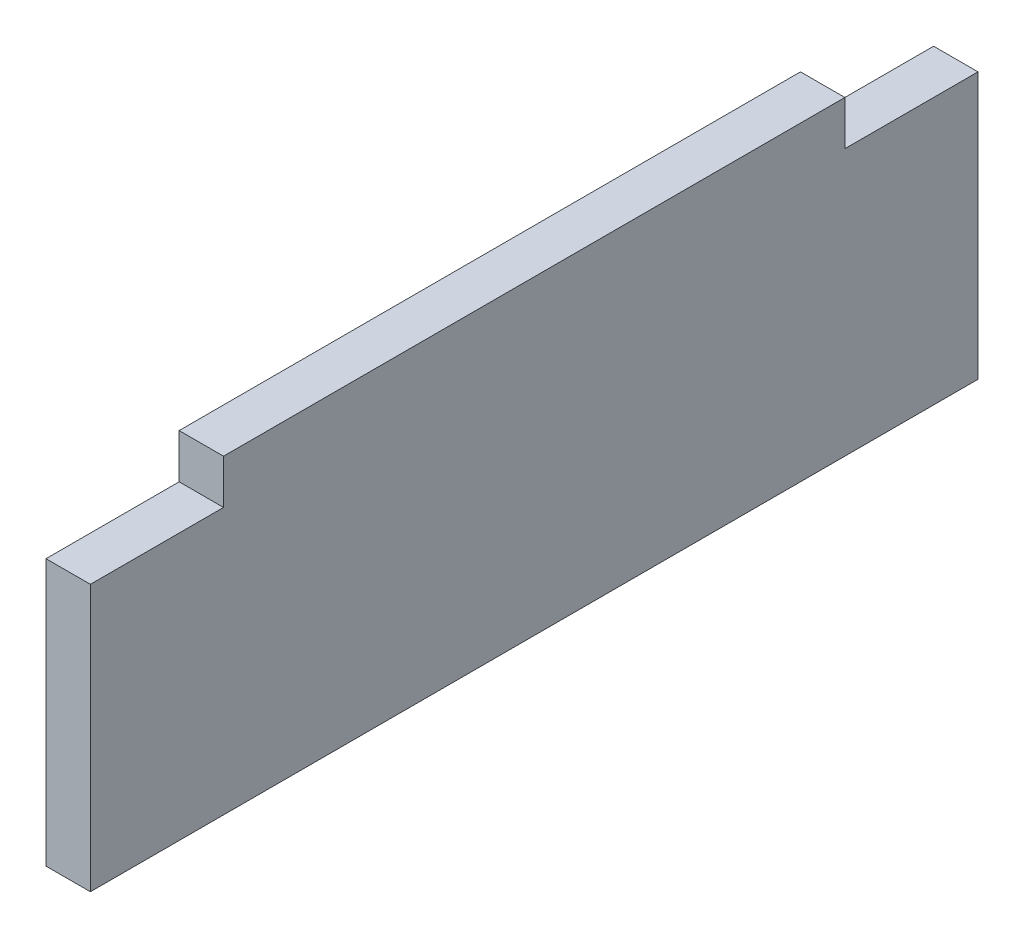
ISO-10303-21;
HEADER;
FILE_DESCRIPTION(('STEP AP214'),'2;1');
FILE_NAME('part.step','',(''),(''),'','','');
FILE_SCHEMA(('AUTOMOTIVE_DESIGN { 1 0 10303 214 1 1 1 1 }'));
ENDSEC;
DATA;
#1=APPLICATION_CONTEXT('core data for automotive mechanical design processes');
#2=APPLICATION_PROTOCOL_DEFINITION('international standard','automotive_design',2000,#1);
#3=PRODUCT_CONTEXT('',#1,'mechanical');
#4=PRODUCT('Part','Part','',(#3));
#5=PRODUCT_RELATED_PRODUCT_CATEGORY('part','',(#4));
#6=PRODUCT_DEFINITION_FORMATION('','',#4);
#7=PRODUCT_DEFINITION_CONTEXT('part definition',#1,'design');
#8=PRODUCT_DEFINITION('design','',#6,#7);
#9=PRODUCT_DEFINITION_SHAPE('','',#8);
#10=(LENGTH_UNIT() NAMED_UNIT(*) SI_UNIT(.MILLI.,.METRE.));
#11=(NAMED_UNIT(*) PLANE_ANGLE_UNIT() SI_UNIT($,.RADIAN.));
#12=(NAMED_UNIT(*) SI_UNIT($,.STERADIAN.) SOLID_ANGLE_UNIT());
#13=UNCERTAINTY_MEASURE_WITH_UNIT(LENGTH_MEASURE(1.E-05),#10,'distance_accuracy_value','');
#14=(GEOMETRIC_REPRESENTATION_CONTEXT(3) GLOBAL_UNCERTAINTY_ASSIGNED_CONTEXT((#13)) GLOBAL_UNIT_ASSIGNED_CONTEXT((#10,
#11,#12)) REPRESENTATION_CONTEXT('',''));
#15=CARTESIAN_POINT('',(0.,0.,0.));
#16=DIRECTION('',(0.,0.,1.));
#17=DIRECTION('',(1.,0.,0.));
#18=AXIS2_PLACEMENT_3D('',#15,#16,#17);
#19=CARTESIAN_POINT('',(5.,30.,85.));
#20=DIRECTION('',(0.,0.,1.));
#21=DIRECTION('',(1.,0.,0.));
#22=AXIS2_PLACEMENT_3D('',#19,#20,#21);
#23=PLANE('',#22);
#24=DIRECTION('',(0.,1.,0.));
#25=VECTOR('',#24,1.);
#26=CARTESIAN_POINT('',(0.,30.,85.));
#27=LINE('',#26,#25);
#28=CARTESIAN_POINT('',(0.,30.,85.));
#29=VERTEX_POINT('',#28);
#30=CARTESIAN_POINT('',(0.,35.,85.));
#31=VERTEX_POINT('',#30);
#32=EDGE_CURVE('E134',#29,#31,#27,.T.);
#33=ORIENTED_EDGE('',*,*,#32,.F.);
#34=DIRECTION('',(-1.,0.,0.));
#35=VECTOR('',#34,1.);
#36=CARTESIAN_POINT('',(5.,30.,85.));
#37=LINE('',#36,#35);
#38=CARTESIAN_POINT('',(5.,30.,85.));
#39=VERTEX_POINT('',#38);
#40=EDGE_CURVE('E11',#39,#29,#37,.T.);
#41=ORIENTED_EDGE('',*,*,#40,.F.);
#42=DIRECTION('',(0.,1.,0.));
#43=VECTOR('',#42,1.);
#44=CARTESIAN_POINT('',(5.,30.,85.));
#45=LINE('',#44,#43);
#46=CARTESIAN_POINT('',(5.,35.,85.));
#47=VERTEX_POINT('',#46);
#48=EDGE_CURVE('E152',#39,#47,#45,.T.);
#49=ORIENTED_EDGE('',*,*,#48,.T.);
#50=DIRECTION('',(-1.,0.,0.));
#51=VECTOR('',#50,1.);
#52=CARTESIAN_POINT('',(5.,35.,85.));
#53=LINE('',#52,#51);
#54=EDGE_CURVE('E40',#47,#31,#53,.T.);
#55=ORIENTED_EDGE('',*,*,#54,.T.);
#56=EDGE_LOOP('',(#33,#41,#49,#55));
#57=FACE_BOUND('',#56,.T.);
#58=ADVANCED_FACE('F37',(#57),#23,.T.);
#59=CARTESIAN_POINT('',(5.,30.,85.));
#60=DIRECTION('',(0.,-1.,0.));
#61=DIRECTION('',(0.,0.,-1.));
#62=AXIS2_PLACEMENT_3D('',#59,#60,#61);
#63=PLANE('',#62);
#64=DIRECTION('',(0.,0.,1.));
#65=VECTOR('',#64,1.);
#66=CARTESIAN_POINT('',(0.,30.,85.));
#67=LINE('',#66,#65);
#68=CARTESIAN_POINT('',(0.,30.,100.));
#69=VERTEX_POINT('',#68);
#70=EDGE_CURVE('E151',#29,#69,#67,.T.);
#71=ORIENTED_EDGE('',*,*,#70,.T.);
#72=DIRECTION('',(-1.,0.,0.));
#73=VECTOR('',#72,1.);
#74=CARTESIAN_POINT('',(5.,30.,100.));
#75=LINE('',#74,#73);
#76=CARTESIAN_POINT('',(5.,30.,100.));
#77=VERTEX_POINT('',#76);
#78=EDGE_CURVE('E46',#77,#69,#75,.T.);
#79=ORIENTED_EDGE('',*,*,#78,.F.);
#80=DIRECTION('',(0.,0.,1.));
#81=VECTOR('',#80,1.);
#82=CARTESIAN_POINT('',(5.,30.,85.));
#83=LINE('',#82,#81);
#84=EDGE_CURVE('E123',#39,#77,#83,.T.);
#85=ORIENTED_EDGE('',*,*,#84,.F.);
#86=ORIENTED_EDGE('',*,*,#40,.T.);
#87=EDGE_LOOP('',(#71,#79,#85,#86));
#88=FACE_BOUND('',#87,.T.);
#89=ADVANCED_FACE('F165',(#88),#63,.F.);
#90=CARTESIAN_POINT('',(5.,0.,100.));
#91=DIRECTION('',(0.,0.,1.));
#92=DIRECTION('',(1.,0.,0.));
#93=AXIS2_PLACEMENT_3D('',#90,#91,#92);
#94=PLANE('',#93);
#95=DIRECTION('',(0.,1.,0.));
#96=VECTOR('',#95,1.);
#97=CARTESIAN_POINT('',(0.,0.,100.));
#98=LINE('',#97,#96);
#99=CARTESIAN_POINT('',(0.,0.,100.));
#100=VERTEX_POINT('',#99);
#101=EDGE_CURVE('E111',#100,#69,#98,.T.);
#102=ORIENTED_EDGE('',*,*,#101,.F.);
#103=DIRECTION('',(-1.,0.,0.));
#104=VECTOR('',#103,1.);
#105=CARTESIAN_POINT('',(5.,0.,100.));
#106=LINE('',#105,#104);
#107=CARTESIAN_POINT('',(5.,0.,100.));
#108=VERTEX_POINT('',#107);
#109=EDGE_CURVE('E106',#108,#100,#106,.T.);
#110=ORIENTED_EDGE('',*,*,#109,.F.);
#111=DIRECTION('',(0.,1.,0.));
#112=VECTOR('',#111,1.);
#113=CARTESIAN_POINT('',(5.,0.,100.));
#114=LINE('',#113,#112);
#115=EDGE_CURVE('E109',#108,#77,#114,.T.);
#116=ORIENTED_EDGE('',*,*,#115,.T.);
#117=ORIENTED_EDGE('',*,*,#78,.T.);
#118=EDGE_LOOP('',(#102,#110,#116,#117));
#119=FACE_BOUND('',#118,.T.);
#120=ADVANCED_FACE('F108',(#119),#94,.T.);
#121=CARTESIAN_POINT('',(5.,0.,0.));
#122=DIRECTION('',(0.,-1.,0.));
#123=DIRECTION('',(0.,0.,-1.));
#124=AXIS2_PLACEMENT_3D('',#121,#122,#123);
#125=PLANE('',#124);
#126=DIRECTION('',(0.,0.,1.));
#127=VECTOR('',#126,1.);
#128=CARTESIAN_POINT('',(0.,0.,0.));
#129=LINE('',#128,#127);
#130=CARTESIAN_POINT('',(0.,0.,0.));
#131=VERTEX_POINT('',#130);
#132=EDGE_CURVE('E148',#131,#100,#129,.T.);
#133=ORIENTED_EDGE('',*,*,#132,.F.);
#134=DIRECTION('',(-1.,0.,0.));
#135=VECTOR('',#134,1.);
#136=CARTESIAN_POINT('',(5.,0.,0.));
#137=LINE('',#136,#135);
#138=CARTESIAN_POINT('',(5.,0.,0.));
#139=VERTEX_POINT('',#138);
#140=EDGE_CURVE('E116',#139,#131,#137,.T.);
#141=ORIENTED_EDGE('',*,*,#140,.F.);
#142=DIRECTION('',(0.,0.,1.));
#143=VECTOR('',#142,1.);
#144=CARTESIAN_POINT('',(5.,0.,0.));
#145=LINE('',#144,#143);
#146=EDGE_CURVE('E122',#139,#108,#145,.T.);
#147=ORIENTED_EDGE('',*,*,#146,.T.);
#148=ORIENTED_EDGE('',*,*,#109,.T.);
#149=EDGE_LOOP('',(#133,#141,#147,#148));
#150=FACE_BOUND('',#149,.T.);
#151=ADVANCED_FACE('F125',(#150),#125,.T.);
#152=CARTESIAN_POINT('',(5.,0.,0.));
#153=DIRECTION('',(0.,0.,1.));
#154=DIRECTION('',(1.,0.,0.));
#155=AXIS2_PLACEMENT_3D('',#152,#153,#154);
#156=PLANE('',#155);
#157=DIRECTION('',(0.,1.,0.));
#158=VECTOR('',#157,1.);
#159=CARTESIAN_POINT('',(0.,0.,0.));
#160=LINE('',#159,#158);
#161=CARTESIAN_POINT('',(0.,30.,0.));
#162=VERTEX_POINT('',#161);
#163=EDGE_CURVE('E146',#131,#162,#160,.T.);
#164=ORIENTED_EDGE('',*,*,#163,.T.);
#165=DIRECTION('',(-1.,0.,0.));
#166=VECTOR('',#165,1.);
#167=CARTESIAN_POINT('',(5.,30.,0.));
#168=LINE('',#167,#166);
#169=CARTESIAN_POINT('',(5.,30.,0.));
#170=VERTEX_POINT('',#169);
#171=EDGE_CURVE('E156',#170,#162,#168,.T.);
#172=ORIENTED_EDGE('',*,*,#171,.F.);
#173=DIRECTION('',(0.,1.,0.));
#174=VECTOR('',#173,1.);
#175=CARTESIAN_POINT('',(5.,0.,0.));
#176=LINE('',#175,#174);
#177=EDGE_CURVE('E127',#139,#170,#176,.T.);
#178=ORIENTED_EDGE('',*,*,#177,.F.);
#179=ORIENTED_EDGE('',*,*,#140,.T.);
#180=EDGE_LOOP('',(#164,#172,#178,#179));
#181=FACE_BOUND('',#180,.T.);
#182=ADVANCED_FACE('F183',(#181),#156,.F.);
#183=CARTESIAN_POINT('',(5.,30.,0.));
#184=DIRECTION('',(0.,-1.,0.));
#185=DIRECTION('',(0.,0.,-1.));
#186=AXIS2_PLACEMENT_3D('',#183,#184,#185);
#187=PLANE('',#186);
#188=DIRECTION('',(0.,0.,1.));
#189=VECTOR('',#188,1.);
#190=CARTESIAN_POINT('',(0.,30.,0.));
#191=LINE('',#190,#189);
#192=CARTESIAN_POINT('',(0.,30.,15.));
#193=VERTEX_POINT('',#192);
#194=EDGE_CURVE('E143',#162,#193,#191,.T.);
#195=ORIENTED_EDGE('',*,*,#194,.T.);
#196=DIRECTION('',(-1.,0.,0.));
#197=VECTOR('',#196,1.);
#198=CARTESIAN_POINT('',(5.,30.,15.));
#199=LINE('',#198,#197);
#200=CARTESIAN_POINT('',(5.,30.,15.));
#201=VERTEX_POINT('',#200);
#202=EDGE_CURVE('E159',#201,#193,#199,.T.);
#203=ORIENTED_EDGE('',*,*,#202,.F.);
#204=DIRECTION('',(0.,0.,1.));
#205=VECTOR('',#204,1.);
#206=CARTESIAN_POINT('',(5.,30.,0.));
#207=LINE('',#206,#205);
#208=EDGE_CURVE('E129',#170,#201,#207,.T.);
#209=ORIENTED_EDGE('',*,*,#208,.F.);
#210=ORIENTED_EDGE('',*,*,#171,.T.);
#211=EDGE_LOOP('',(#195,#203,#209,#210));
#212=FACE_BOUND('',#211,.T.);
#213=ADVANCED_FACE('F177',(#212),#187,.F.);
#214=CARTESIAN_POINT('',(5.,35.,15.));
#215=DIRECTION('',(0.,0.,-1.));
#216=DIRECTION('',(0.,1.,0.));
#217=AXIS2_PLACEMENT_3D('',#214,#215,#216);
#218=PLANE('',#217);
#219=DIRECTION('',(0.,-1.,0.));
#220=VECTOR('',#219,1.);
#221=CARTESIAN_POINT('',(0.,35.,15.));
#222=LINE('',#221,#220);
#223=CARTESIAN_POINT('',(0.,35.,15.));
#224=VERTEX_POINT('',#223);
#225=EDGE_CURVE('E140',#224,#193,#222,.T.);
#226=ORIENTED_EDGE('',*,*,#225,.F.);
#227=DIRECTION('',(-1.,0.,0.));
#228=VECTOR('',#227,1.);
#229=CARTESIAN_POINT('',(5.,35.,15.));
#230=LINE('',#229,#228);
#231=CARTESIAN_POINT('',(5.,35.,15.));
#232=VERTEX_POINT('',#231);
#233=EDGE_CURVE('E160',#232,#224,#230,.T.);
#234=ORIENTED_EDGE('',*,*,#233,.F.);
#235=DIRECTION('',(0.,-1.,0.));
#236=VECTOR('',#235,1.);
#237=CARTESIAN_POINT('',(5.,35.,15.));
#238=LINE('',#237,#236);
#239=EDGE_CURVE('E169',#232,#201,#238,.T.);
#240=ORIENTED_EDGE('',*,*,#239,.T.);
#241=ORIENTED_EDGE('',*,*,#202,.T.);
#242=EDGE_LOOP('',(#226,#234,#240,#241));
#243=FACE_BOUND('',#242,.T.);
#244=ADVANCED_FACE('F180',(#243),#218,.T.);
#245=CARTESIAN_POINT('',(5.,35.,85.));
#246=DIRECTION('',(0.,1.,0.));
#247=DIRECTION('',(0.,0.,1.));
#248=AXIS2_PLACEMENT_3D('',#245,#246,#247);
#249=PLANE('',#248);
#250=DIRECTION('',(0.,0.,-1.));
#251=VECTOR('',#250,1.);
#252=CARTESIAN_POINT('',(0.,35.,85.));
#253=LINE('',#252,#251);
#254=EDGE_CURVE('E137',#31,#224,#253,.T.);
#255=ORIENTED_EDGE('',*,*,#254,.F.);
#256=ORIENTED_EDGE('',*,*,#54,.F.);
#257=DIRECTION('',(0.,0.,-1.));
#258=VECTOR('',#257,1.);
#259=CARTESIAN_POINT('',(5.,35.,85.));
#260=LINE('',#259,#258);
#261=EDGE_CURVE('E167',#47,#232,#260,.T.);
#262=ORIENTED_EDGE('',*,*,#261,.T.);
#263=ORIENTED_EDGE('',*,*,#233,.T.);
#264=EDGE_LOOP('',(#255,#256,#262,#263));
#265=FACE_BOUND('',#264,.T.);
#266=ADVANCED_FACE('F162',(#265),#249,.T.);
#267=CARTESIAN_POINT('',(5.,0.,0.));
#268=DIRECTION('',(-1.,0.,0.));
#269=DIRECTION('',(0.,0.,1.));
#270=AXIS2_PLACEMENT_3D('',#267,#268,#269);
#271=PLANE('',#270);
#272=ORIENTED_EDGE('',*,*,#48,.F.);
#273=ORIENTED_EDGE('',*,*,#84,.T.);
#274=ORIENTED_EDGE('',*,*,#115,.F.);
#275=ORIENTED_EDGE('',*,*,#146,.F.);
#276=ORIENTED_EDGE('',*,*,#177,.T.);
#277=ORIENTED_EDGE('',*,*,#208,.T.);
#278=ORIENTED_EDGE('',*,*,#239,.F.);
#279=ORIENTED_EDGE('',*,*,#261,.F.);
#280=EDGE_LOOP('',(#272,#273,#274,#275,#276,#277,#278,#279));
#281=FACE_BOUND('',#280,.T.);
#282=ADVANCED_FACE('F121',(#281),#271,.F.);
#283=CARTESIAN_POINT('',(0.,0.,0.));
#284=DIRECTION('',(-1.,0.,0.));
#285=DIRECTION('',(0.,0.,1.));
#286=AXIS2_PLACEMENT_3D('',#283,#284,#285);
#287=PLANE('',#286);
#288=ORIENTED_EDGE('',*,*,#32,.T.);
#289=ORIENTED_EDGE('',*,*,#254,.T.);
#290=ORIENTED_EDGE('',*,*,#225,.T.);
#291=ORIENTED_EDGE('',*,*,#194,.F.);
#292=ORIENTED_EDGE('',*,*,#163,.F.);
#293=ORIENTED_EDGE('',*,*,#132,.T.);
#294=ORIENTED_EDGE('',*,*,#101,.T.);
#295=ORIENTED_EDGE('',*,*,#70,.F.);
#296=EDGE_LOOP('',(#288,#289,#290,#291,#292,#293,#294,#295));
#297=FACE_BOUND('',#296,.T.);
#298=ADVANCED_FACE('F164',(#297),#287,.T.);
#299=CLOSED_SHELL('',(#58,#89,#120,#151,#182,#213,#244,#266,#282,#298));
#300=MANIFOLD_SOLID_BREP('B2',#299);
#301=ADVANCED_BREP_SHAPE_REPRESENTATION('',(#18,#300),#14);
#302=SHAPE_DEFINITION_REPRESENTATION(#9,#301);
ENDSEC;
END-ISO-10303-21;
